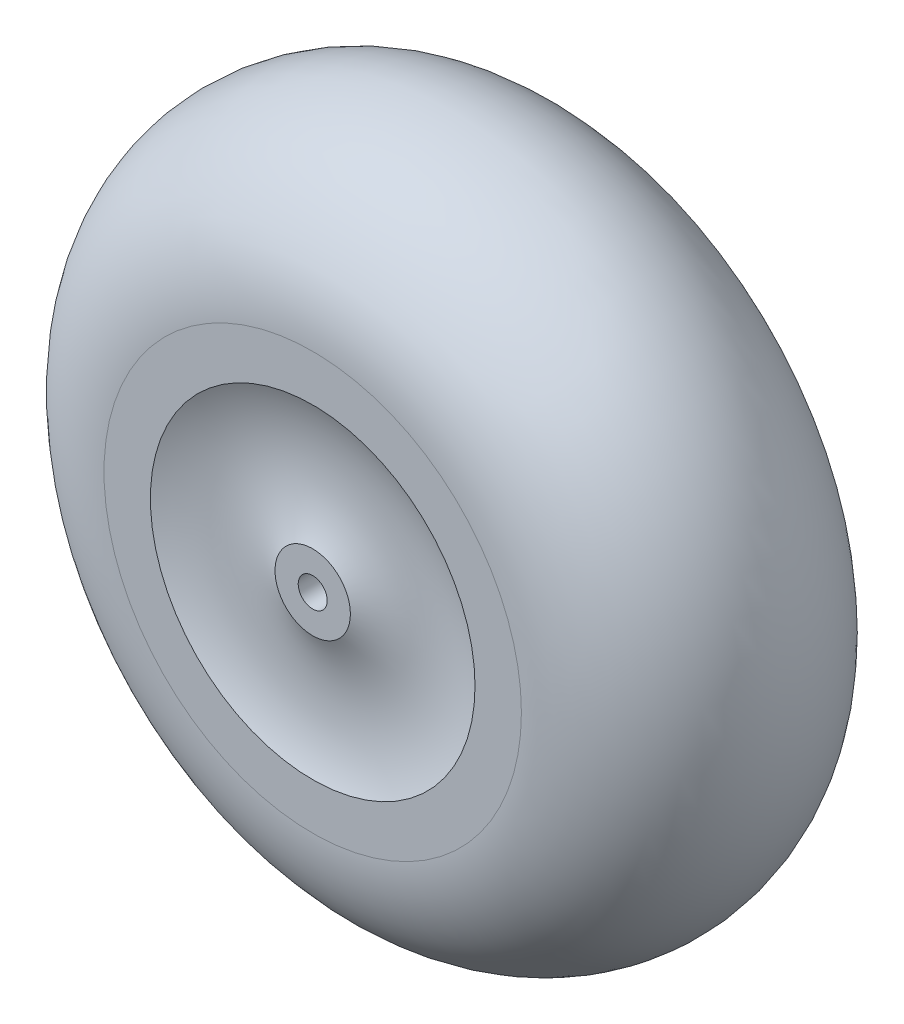
ISO-10303-21;
HEADER;
FILE_DESCRIPTION(('STEP AP214'),'2;1');
FILE_NAME('part.step','',(''),(''),'','','');
FILE_SCHEMA(('AUTOMOTIVE_DESIGN { 1 0 10303 214 1 1 1 1 }'));
ENDSEC;
DATA;
#1=APPLICATION_CONTEXT('core data for automotive mechanical design processes');
#2=APPLICATION_PROTOCOL_DEFINITION('international standard','automotive_design',2000,#1);
#3=PRODUCT_CONTEXT('',#1,'mechanical');
#4=PRODUCT('Part','Part','',(#3));
#5=PRODUCT_RELATED_PRODUCT_CATEGORY('part','',(#4));
#6=PRODUCT_DEFINITION_FORMATION('','',#4);
#7=PRODUCT_DEFINITION_CONTEXT('part definition',#1,'design');
#8=PRODUCT_DEFINITION('design','',#6,#7);
#9=PRODUCT_DEFINITION_SHAPE('','',#8);
#10=(LENGTH_UNIT() NAMED_UNIT(*) SI_UNIT(.MILLI.,.METRE.));
#11=(NAMED_UNIT(*) PLANE_ANGLE_UNIT() SI_UNIT($,.RADIAN.));
#12=(NAMED_UNIT(*) SI_UNIT($,.STERADIAN.) SOLID_ANGLE_UNIT());
#13=UNCERTAINTY_MEASURE_WITH_UNIT(LENGTH_MEASURE(1.E-05),#10,'distance_accuracy_value','');
#14=(GEOMETRIC_REPRESENTATION_CONTEXT(3) GLOBAL_UNCERTAINTY_ASSIGNED_CONTEXT((#13)) GLOBAL_UNIT_ASSIGNED_CONTEXT((#10,
#11,#12)) REPRESENTATION_CONTEXT('',''));
#15=CARTESIAN_POINT('',(0.,0.,0.));
#16=DIRECTION('',(0.,0.,1.));
#17=DIRECTION('',(1.,0.,0.));
#18=AXIS2_PLACEMENT_3D('',#15,#16,#17);
#19=CARTESIAN_POINT('',(-7.9375,0.,25.4));
#20=DIRECTION('',(0.,0.,-1.));
#21=DIRECTION('',(-1.,0.,0.));
#22=AXIS2_PLACEMENT_3D('',#19,#20,#21);
#23=PLANE('',#22);
#24=CARTESIAN_POINT('',(0.,0.,25.4));
#25=DIRECTION('',(0.,0.,1.));
#26=DIRECTION('',(1.,0.,0.));
#27=AXIS2_PLACEMENT_3D('',#24,#25,#26);
#28=CIRCLE('',#27,7.9375);
#29=CARTESIAN_POINT('',(7.9375,0.,25.4));
#30=VERTEX_POINT('',#29);
#31=EDGE_CURVE('E10',#30,#30,#28,.T.);
#32=ORIENTED_EDGE('',*,*,#31,.F.);
#33=EDGE_LOOP('',(#32));
#34=FACE_BOUND('',#33,.T.);
#35=CARTESIAN_POINT('',(0.,0.,25.4));
#36=DIRECTION('',(0.,0.,1.));
#37=DIRECTION('',(1.,0.,0.));
#38=AXIS2_PLACEMENT_3D('',#35,#36,#37);
#39=CIRCLE('',#38,20.6375);
#40=CARTESIAN_POINT('',(20.6375,0.,25.4));
#41=VERTEX_POINT('',#40);
#42=EDGE_CURVE('E67',#41,#41,#39,.T.);
#43=ORIENTED_EDGE('',*,*,#42,.T.);
#44=EDGE_LOOP('',(#43));
#45=FACE_BOUND('',#44,.T.);
#46=ADVANCED_FACE('F33',(#34,#45),#23,.F.);
#47=CARTESIAN_POINT('',(0.,0.,25.4));
#48=DIRECTION('',(0.,0.,1.));
#49=DIRECTION('',(1.,0.,0.));
#50=AXIS2_PLACEMENT_3D('',#47,#48,#49);
#51=CYLINDRICAL_SURFACE('',#50,7.9375);
#52=CARTESIAN_POINT('',(0.,0.,-25.4));
#53=DIRECTION('',(0.,0.,1.));
#54=DIRECTION('',(1.,0.,0.));
#55=AXIS2_PLACEMENT_3D('',#52,#53,#54);
#56=CIRCLE('',#55,7.93750000000001);
#57=CARTESIAN_POINT('',(7.93750000000001,0.,-25.4));
#58=VERTEX_POINT('',#57);
#59=EDGE_CURVE('E39',#58,#58,#56,.T.);
#60=ORIENTED_EDGE('',*,*,#59,.F.);
#61=EDGE_LOOP('',(#60));
#62=FACE_BOUND('',#61,.T.);
#63=ORIENTED_EDGE('',*,*,#31,.T.);
#64=EDGE_LOOP('',(#63));
#65=FACE_BOUND('',#64,.T.);
#66=ADVANCED_FACE('F116',(#62,#65),#51,.F.);
#67=CARTESIAN_POINT('',(-7.93750000000001,0.,-25.4));
#68=DIRECTION('',(0.,0.,1.));
#69=DIRECTION('',(1.,0.,0.));
#70=AXIS2_PLACEMENT_3D('',#67,#68,#69);
#71=PLANE('',#70);
#72=CARTESIAN_POINT('',(0.,0.,-25.4));
#73=DIRECTION('',(0.,0.,1.));
#74=DIRECTION('',(1.,0.,0.));
#75=AXIS2_PLACEMENT_3D('',#72,#73,#74);
#76=CIRCLE('',#75,20.6375);
#77=CARTESIAN_POINT('',(20.6375,0.,-25.4));
#78=VERTEX_POINT('',#77);
#79=EDGE_CURVE('E43',#78,#78,#76,.T.);
#80=ORIENTED_EDGE('',*,*,#79,.F.);
#81=EDGE_LOOP('',(#80));
#82=FACE_BOUND('',#81,.T.);
#83=ORIENTED_EDGE('',*,*,#59,.T.);
#84=EDGE_LOOP('',(#83));
#85=FACE_BOUND('',#84,.T.);
#86=ADVANCED_FACE('F111',(#82,#85),#71,.F.);
#87=CARTESIAN_POINT('',(0.,0.,25.4));
#88=DIRECTION('',(0.,0.,1.));
#89=DIRECTION('',(1.,0.,0.));
#90=AXIS2_PLACEMENT_3D('',#87,#88,#89);
#91=CYLINDRICAL_SURFACE('',#90,20.6375);
#92=CARTESIAN_POINT('',(0.,0.,19.05));
#93=DIRECTION('',(0.,0.,1.));
#94=DIRECTION('',(1.,0.,0.));
#95=AXIS2_PLACEMENT_3D('',#92,#93,#94);
#96=CIRCLE('',#95,20.6375);
#97=CARTESIAN_POINT('',(20.6375,0.,19.05));
#98=VERTEX_POINT('',#97);
#99=EDGE_CURVE('E47',#98,#98,#96,.T.);
#100=ORIENTED_EDGE('',*,*,#99,.F.);
#101=EDGE_LOOP('',(#100));
#102=FACE_BOUND('',#101,.T.);
#103=ORIENTED_EDGE('',*,*,#79,.T.);
#104=EDGE_LOOP('',(#103));
#105=FACE_BOUND('',#104,.T.);
#106=ADVANCED_FACE('F105',(#102,#105),#91,.T.);
#107=CARTESIAN_POINT('',(0.,0.,92.0292010476538));
#108=DIRECTION('',(0.,0.,1.));
#109=DIRECTION('',(1.,0.,0.));
#110=AXIS2_PLACEMENT_3D('',#107,#108,#109);
#111=DEGENERATE_TOROIDAL_SURFACE('',#110,54.7687501379682,80.5661592825079,.T.);
#112=CARTESIAN_POINT('',(0.,0.,19.05));
#113=DIRECTION('',(0.,0.,1.));
#114=DIRECTION('',(1.,0.,0.));
#115=AXIS2_PLACEMENT_3D('',#112,#113,#114);
#116=CIRCLE('',#115,88.9000002759364);
#117=CARTESIAN_POINT('',(88.9000002759364,0.,19.05));
#118=VERTEX_POINT('',#117);
#119=EDGE_CURVE('E52',#118,#118,#116,.T.);
#120=ORIENTED_EDGE('',*,*,#119,.F.);
#121=EDGE_LOOP('',(#120));
#122=FACE_BOUND('',#121,.T.);
#123=ORIENTED_EDGE('',*,*,#99,.T.);
#124=EDGE_LOOP('',(#123));
#125=FACE_BOUND('',#124,.T.);
#126=ADVANCED_FACE('F99',(#122,#125),#111,.T.);
#127=CARTESIAN_POINT('',(0.,0.,25.4));
#128=DIRECTION('',(0.,0.,1.));
#129=DIRECTION('',(1.,0.,0.));
#130=AXIS2_PLACEMENT_3D('',#127,#128,#129);
#131=CYLINDRICAL_SURFACE('',#130,88.9000002759364);
#132=CARTESIAN_POINT('',(0.,0.,-126.999998896254));
#133=DIRECTION('',(0.,0.,1.));
#134=DIRECTION('',(1.,0.,0.));
#135=AXIS2_PLACEMENT_3D('',#132,#133,#134);
#136=CIRCLE('',#135,88.9000002759364);
#137=CARTESIAN_POINT('',(88.9000002759364,0.,-126.999998896254));
#138=VERTEX_POINT('',#137);
#139=EDGE_CURVE('E55',#138,#138,#136,.T.);
#140=ORIENTED_EDGE('',*,*,#139,.F.);
#141=EDGE_LOOP('',(#140));
#142=FACE_BOUND('',#141,.T.);
#143=ORIENTED_EDGE('',*,*,#119,.T.);
#144=EDGE_LOOP('',(#143));
#145=FACE_BOUND('',#144,.T.);
#146=ADVANCED_FACE('F93',(#142,#145),#131,.F.);
#147=CARTESIAN_POINT('',(-114.312969887378,0.,-126.999998896254));
#148=DIRECTION('',(0.,0.,1.));
#149=DIRECTION('',(1.,0.,0.));
#150=AXIS2_PLACEMENT_3D('',#147,#148,#149);
#151=PLANE('',#150);
#152=CARTESIAN_POINT('',(0.,0.,-126.999998896254));
#153=DIRECTION('',(0.,0.,1.));
#154=DIRECTION('',(1.,0.,0.));
#155=AXIS2_PLACEMENT_3D('',#152,#153,#154);
#156=CIRCLE('',#155,114.312969887378);
#157=CARTESIAN_POINT('',(114.312969887378,0.,-126.999998896254));
#158=VERTEX_POINT('',#157);
#159=EDGE_CURVE('E58',#158,#158,#156,.T.);
#160=ORIENTED_EDGE('',*,*,#159,.F.);
#161=EDGE_LOOP('',(#160));
#162=FACE_BOUND('',#161,.T.);
#163=ORIENTED_EDGE('',*,*,#139,.T.);
#164=EDGE_LOOP('',(#163));
#165=FACE_BOUND('',#164,.T.);
#166=ADVANCED_FACE('F87',(#162,#165),#151,.F.);
#167=CARTESIAN_POINT('',(0.,0.,-50.8));
#168=DIRECTION('',(0.,0.,1.));
#169=DIRECTION('',(1.,0.,0.));
#170=AXIS2_PLACEMENT_3D('',#167,#168,#169);
#171=TOROIDAL_SURFACE('',#170,114.300000275936,76.2);
#172=CARTESIAN_POINT('',(0.,0.,25.4));
#173=DIRECTION('',(0.,0.,1.));
#174=DIRECTION('',(1.,0.,0.));
#175=AXIS2_PLACEMENT_3D('',#172,#173,#174);
#176=CIRCLE('',#175,114.300000275936);
#177=CARTESIAN_POINT('',(114.300000275936,0.,25.4));
#178=VERTEX_POINT('',#177);
#179=EDGE_CURVE('E61',#178,#178,#176,.T.);
#180=ORIENTED_EDGE('',*,*,#179,.F.);
#181=EDGE_LOOP('',(#180));
#182=FACE_BOUND('',#181,.T.);
#183=ORIENTED_EDGE('',*,*,#159,.T.);
#184=EDGE_LOOP('',(#183));
#185=FACE_BOUND('',#184,.T.);
#186=ADVANCED_FACE('F81',(#182,#185),#171,.T.);
#187=CARTESIAN_POINT('',(-88.9000002759364,0.,25.4));
#188=DIRECTION('',(0.,0.,-1.));
#189=DIRECTION('',(-1.,0.,0.));
#190=AXIS2_PLACEMENT_3D('',#187,#188,#189);
#191=PLANE('',#190);
#192=CARTESIAN_POINT('',(0.,0.,25.4));
#193=DIRECTION('',(0.,0.,1.));
#194=DIRECTION('',(1.,0.,0.));
#195=AXIS2_PLACEMENT_3D('',#192,#193,#194);
#196=CIRCLE('',#195,88.9000002759364);
#197=CARTESIAN_POINT('',(88.9000002759364,0.,25.4));
#198=VERTEX_POINT('',#197);
#199=EDGE_CURVE('E64',#198,#198,#196,.T.);
#200=ORIENTED_EDGE('',*,*,#199,.F.);
#201=EDGE_LOOP('',(#200));
#202=FACE_BOUND('',#201,.T.);
#203=ORIENTED_EDGE('',*,*,#179,.T.);
#204=EDGE_LOOP('',(#203));
#205=FACE_BOUND('',#204,.T.);
#206=ADVANCED_FACE('F75',(#202,#205),#191,.F.);
#207=CARTESIAN_POINT('',(0.,0.,98.3792010476538));
#208=DIRECTION('',(0.,0.,1.));
#209=DIRECTION('',(1.,0.,0.));
#210=AXIS2_PLACEMENT_3D('',#207,#208,#209);
#211=DEGENERATE_TOROIDAL_SURFACE('',#210,54.7687501379682,80.5661592825079,.T.);
#212=ORIENTED_EDGE('',*,*,#42,.F.);
#213=EDGE_LOOP('',(#212));
#214=FACE_BOUND('',#213,.T.);
#215=ORIENTED_EDGE('',*,*,#199,.T.);
#216=EDGE_LOOP('',(#215));
#217=FACE_BOUND('',#216,.T.);
#218=ADVANCED_FACE('F72',(#214,#217),#211,.F.);
#219=CLOSED_SHELL('',(#46,#66,#86,#106,#126,#146,#166,#186,#206,#218));
#220=MANIFOLD_SOLID_BREP('B2',#219);
#221=ADVANCED_BREP_SHAPE_REPRESENTATION('',(#18,#220),#14);
#222=SHAPE_DEFINITION_REPRESENTATION(#9,#221);
ENDSEC;
END-ISO-10303-21;
